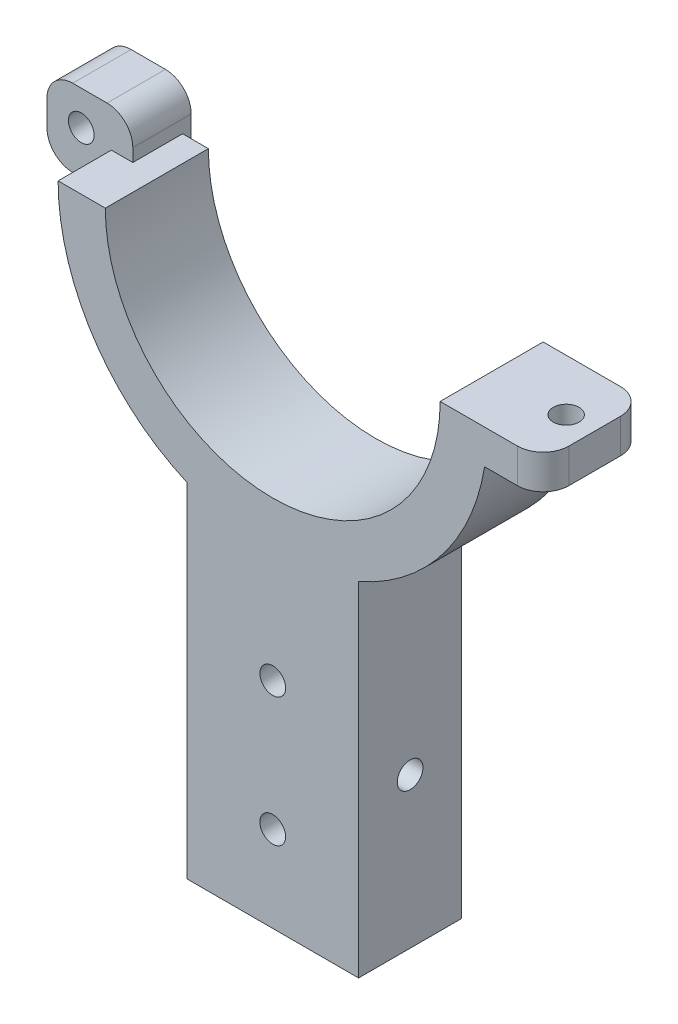
ISO-10303-21;
HEADER;
FILE_DESCRIPTION(('STEP AP214'),'2;1');
FILE_NAME('part.step','',(''),(''),'','','');
FILE_SCHEMA(('AUTOMOTIVE_DESIGN { 1 0 10303 214 1 1 1 1 }'));
ENDSEC;
DATA;
#1=APPLICATION_CONTEXT('core data for automotive mechanical design processes');
#2=APPLICATION_PROTOCOL_DEFINITION('international standard','automotive_design',2000,#1);
#3=PRODUCT_CONTEXT('',#1,'mechanical');
#4=PRODUCT('Part','Part','',(#3));
#5=PRODUCT_RELATED_PRODUCT_CATEGORY('part','',(#4));
#6=PRODUCT_DEFINITION_FORMATION('','',#4);
#7=PRODUCT_DEFINITION_CONTEXT('part definition',#1,'design');
#8=PRODUCT_DEFINITION('design','',#6,#7);
#9=PRODUCT_DEFINITION_SHAPE('','',#8);
#10=(LENGTH_UNIT() NAMED_UNIT(*) SI_UNIT(.MILLI.,.METRE.));
#11=(NAMED_UNIT(*) PLANE_ANGLE_UNIT() SI_UNIT($,.RADIAN.));
#12=(NAMED_UNIT(*) SI_UNIT($,.STERADIAN.) SOLID_ANGLE_UNIT());
#13=UNCERTAINTY_MEASURE_WITH_UNIT(LENGTH_MEASURE(1.E-05),#10,'distance_accuracy_value','');
#14=(GEOMETRIC_REPRESENTATION_CONTEXT(3) GLOBAL_UNCERTAINTY_ASSIGNED_CONTEXT((#13)) GLOBAL_UNIT_ASSIGNED_CONTEXT((#10,
#11,#12)) REPRESENTATION_CONTEXT('',''));
#15=CARTESIAN_POINT('',(0.,0.,0.));
#16=DIRECTION('',(0.,0.,1.));
#17=DIRECTION('',(1.,0.,0.));
#18=AXIS2_PLACEMENT_3D('',#15,#16,#17);
#19=CARTESIAN_POINT('',(28.4999999999988,0.,9.));
#20=DIRECTION('',(0.,1.,0.));
#21=DIRECTION('',(0.,0.,1.));
#22=AXIS2_PLACEMENT_3D('',#19,#20,#21);
#23=CYLINDRICAL_SURFACE('',#22,3.);
#24=DIRECTION('',(0.,1.,0.));
#25=VECTOR('',#24,1.);
#26=CARTESIAN_POINT('',(28.4999999999988,0.,12.));
#27=LINE('',#26,#25);
#28=CARTESIAN_POINT('',(28.4999999999988,-3.99999999999576,12.));
#29=VERTEX_POINT('',#28);
#30=CARTESIAN_POINT('',(28.4999999999988,4.24313362223927E-12,12.));
#31=VERTEX_POINT('',#30);
#32=EDGE_CURVE('E317',#29,#31,#27,.T.);
#33=ORIENTED_EDGE('',*,*,#32,.F.);
#34=CARTESIAN_POINT('',(28.4999999999988,-3.99999999999576,9.));
#35=DIRECTION('',(0.,-1.,0.));
#36=DIRECTION('',(0.,0.,-1.));
#37=AXIS2_PLACEMENT_3D('',#34,#35,#36);
#38=CIRCLE('',#37,3.);
#39=CARTESIAN_POINT('',(31.4999999999988,-3.99999999999576,9.));
#40=VERTEX_POINT('',#39);
#41=EDGE_CURVE('E44',#40,#29,#38,.T.);
#42=ORIENTED_EDGE('',*,*,#41,.F.);
#43=DIRECTION('',(0.,1.,0.));
#44=VECTOR('',#43,1.);
#45=CARTESIAN_POINT('',(31.4999999999988,4.24313362223927E-12,9.));
#46=LINE('',#45,#44);
#47=CARTESIAN_POINT('',(31.4999999999988,4.24313362223927E-12,9.));
#48=VERTEX_POINT('',#47);
#49=EDGE_CURVE('E320',#48,#40,#46,.F.);
#50=ORIENTED_EDGE('',*,*,#49,.F.);
#51=CARTESIAN_POINT('',(28.4999999999988,4.24313362223927E-12,9.));
#52=DIRECTION('',(0.,1.,0.));
#53=DIRECTION('',(0.,0.,1.));
#54=AXIS2_PLACEMENT_3D('',#51,#52,#53);
#55=CIRCLE('',#54,3.);
#56=EDGE_CURVE('E11',#31,#48,#55,.T.);
#57=ORIENTED_EDGE('',*,*,#56,.F.);
#58=EDGE_LOOP('',(#33,#42,#50,#57));
#59=FACE_BOUND('',#58,.T.);
#60=ADVANCED_FACE('F36',(#59),#23,.T.);
#61=CARTESIAN_POINT('',(28.4999999999988,0.,3.));
#62=DIRECTION('',(0.,1.,0.));
#63=DIRECTION('',(0.,0.,1.));
#64=AXIS2_PLACEMENT_3D('',#61,#62,#63);
#65=CYLINDRICAL_SURFACE('',#64,3.);
#66=DIRECTION('',(0.,-1.,0.));
#67=VECTOR('',#66,1.);
#68=CARTESIAN_POINT('',(28.4999999999988,0.,0.));
#69=LINE('',#68,#67);
#70=CARTESIAN_POINT('',(28.4999999999988,4.24313362223927E-12,0.));
#71=VERTEX_POINT('',#70);
#72=CARTESIAN_POINT('',(28.4999999999988,-3.99999999999576,0.));
#73=VERTEX_POINT('',#72);
#74=EDGE_CURVE('E306',#71,#73,#69,.T.);
#75=ORIENTED_EDGE('',*,*,#74,.F.);
#76=CARTESIAN_POINT('',(28.4999999999988,4.24313362223927E-12,3.));
#77=DIRECTION('',(0.,1.,0.));
#78=DIRECTION('',(0.,0.,1.));
#79=AXIS2_PLACEMENT_3D('',#76,#77,#78);
#80=CIRCLE('',#79,3.);
#81=CARTESIAN_POINT('',(31.4999999999988,4.24313362223927E-12,3.));
#82=VERTEX_POINT('',#81);
#83=EDGE_CURVE('E312',#82,#71,#80,.T.);
#84=ORIENTED_EDGE('',*,*,#83,.F.);
#85=DIRECTION('',(0.,-1.,0.));
#86=VECTOR('',#85,1.);
#87=CARTESIAN_POINT('',(31.4999999999988,0.,3.));
#88=LINE('',#87,#86);
#89=CARTESIAN_POINT('',(31.4999999999988,-3.99999999999576,3.));
#90=VERTEX_POINT('',#89);
#91=EDGE_CURVE('E309',#90,#82,#88,.F.);
#92=ORIENTED_EDGE('',*,*,#91,.F.);
#93=CARTESIAN_POINT('',(28.4999999999988,-3.99999999999576,3.));
#94=DIRECTION('',(0.,-1.,0.));
#95=DIRECTION('',(0.,0.,-1.));
#96=AXIS2_PLACEMENT_3D('',#93,#94,#95);
#97=CIRCLE('',#96,3.);
#98=EDGE_CURVE('E314',#73,#90,#97,.T.);
#99=ORIENTED_EDGE('',*,*,#98,.F.);
#100=EDGE_LOOP('',(#75,#84,#92,#99));
#101=FACE_BOUND('',#100,.T.);
#102=ADVANCED_FACE('F420',(#101),#65,.T.);
#103=CARTESIAN_POINT('',(-25.4999999999956,1.50000000000424,-1.));
#104=DIRECTION('',(0.,0.,1.));
#105=DIRECTION('',(1.,0.,0.));
#106=AXIS2_PLACEMENT_3D('',#103,#104,#105);
#107=CYLINDRICAL_SURFACE('',#106,3.);
#108=DIRECTION('',(0.,0.,1.));
#109=VECTOR('',#108,1.);
#110=CARTESIAN_POINT('',(-22.4999999999956,1.50000000000424,-1.));
#111=LINE('',#110,#109);
#112=CARTESIAN_POINT('',(-22.4999999999956,1.50000000000424,-1.));
#113=VERTEX_POINT('',#112);
#114=CARTESIAN_POINT('',(-22.4999999999956,1.50000000000424,5.8));
#115=VERTEX_POINT('',#114);
#116=EDGE_CURVE('E298',#113,#115,#111,.T.);
#117=ORIENTED_EDGE('',*,*,#116,.F.);
#118=CARTESIAN_POINT('',(-25.4999999999956,1.50000000000424,-1.));
#119=DIRECTION('',(0.,0.,-1.));
#120=DIRECTION('',(-1.,0.,0.));
#121=AXIS2_PLACEMENT_3D('',#118,#119,#120);
#122=CIRCLE('',#121,3.);
#123=CARTESIAN_POINT('',(-25.4999999999956,4.50000000000424,-1.));
#124=VERTEX_POINT('',#123);
#125=EDGE_CURVE('E182',#124,#113,#122,.T.);
#126=ORIENTED_EDGE('',*,*,#125,.F.);
#127=DIRECTION('',(0.,0.,1.));
#128=VECTOR('',#127,1.);
#129=CARTESIAN_POINT('',(-25.4999999999956,4.50000000000424,-1.));
#130=LINE('',#129,#128);
#131=CARTESIAN_POINT('',(-25.4999999999956,4.50000000000424,5.8));
#132=VERTEX_POINT('',#131);
#133=EDGE_CURVE('E300',#132,#124,#130,.F.);
#134=ORIENTED_EDGE('',*,*,#133,.F.);
#135=CARTESIAN_POINT('',(-25.4999999999956,1.50000000000424,5.8));
#136=DIRECTION('',(0.,0.,-1.));
#137=DIRECTION('',(-1.,0.,0.));
#138=AXIS2_PLACEMENT_3D('',#135,#136,#137);
#139=CIRCLE('',#138,3.);
#140=EDGE_CURVE('E304',#115,#132,#139,.F.);
#141=ORIENTED_EDGE('',*,*,#140,.F.);
#142=EDGE_LOOP('',(#117,#126,#134,#141));
#143=FACE_BOUND('',#142,.T.);
#144=ADVANCED_FACE('F378',(#143),#107,.T.);
#145=CARTESIAN_POINT('',(-29.4999999999956,1.50000000000424,-1.));
#146=DIRECTION('',(0.,0.,1.));
#147=DIRECTION('',(1.,0.,0.));
#148=AXIS2_PLACEMENT_3D('',#145,#146,#147);
#149=CYLINDRICAL_SURFACE('',#148,3.);
#150=DIRECTION('',(0.,0.,1.));
#151=VECTOR('',#150,1.);
#152=CARTESIAN_POINT('',(-29.4999999999956,4.50000000000424,-1.));
#153=LINE('',#152,#151);
#154=CARTESIAN_POINT('',(-29.4999999999956,4.50000000000424,-1.));
#155=VERTEX_POINT('',#154);
#156=CARTESIAN_POINT('',(-29.4999999999956,4.50000000000424,5.8));
#157=VERTEX_POINT('',#156);
#158=EDGE_CURVE('E288',#155,#157,#153,.T.);
#159=ORIENTED_EDGE('',*,*,#158,.F.);
#160=CARTESIAN_POINT('',(-29.4999999999956,1.50000000000424,-1.));
#161=DIRECTION('',(0.,0.,-1.));
#162=DIRECTION('',(-1.,0.,0.));
#163=AXIS2_PLACEMENT_3D('',#160,#161,#162);
#164=CIRCLE('',#163,3.);
#165=CARTESIAN_POINT('',(-32.4999999999956,1.50000000000424,-1.));
#166=VERTEX_POINT('',#165);
#167=EDGE_CURVE('E294',#166,#155,#164,.T.);
#168=ORIENTED_EDGE('',*,*,#167,.F.);
#169=DIRECTION('',(0.,0.,1.));
#170=VECTOR('',#169,1.);
#171=CARTESIAN_POINT('',(-32.4999999999956,1.50000000000424,-1.));
#172=LINE('',#171,#170);
#173=CARTESIAN_POINT('',(-32.4999999999956,1.50000000000424,5.8));
#174=VERTEX_POINT('',#173);
#175=EDGE_CURVE('E291',#174,#166,#172,.F.);
#176=ORIENTED_EDGE('',*,*,#175,.F.);
#177=CARTESIAN_POINT('',(-29.4999999999956,1.50000000000424,5.8));
#178=DIRECTION('',(0.,0.,-1.));
#179=DIRECTION('',(-1.,0.,0.));
#180=AXIS2_PLACEMENT_3D('',#177,#178,#179);
#181=CIRCLE('',#180,3.);
#182=EDGE_CURVE('E296',#157,#174,#181,.F.);
#183=ORIENTED_EDGE('',*,*,#182,.F.);
#184=EDGE_LOOP('',(#159,#168,#176,#183));
#185=FACE_BOUND('',#184,.T.);
#186=ADVANCED_FACE('F371',(#185),#149,.T.);
#187=CARTESIAN_POINT('',(-29.4999999999956,-1.49999999999576,-1.));
#188=DIRECTION('',(0.,0.,1.));
#189=DIRECTION('',(1.,0.,0.));
#190=AXIS2_PLACEMENT_3D('',#187,#188,#189);
#191=CYLINDRICAL_SURFACE('',#190,3.);
#192=DIRECTION('',(0.,0.,1.));
#193=VECTOR('',#192,1.);
#194=CARTESIAN_POINT('',(-32.4999999999956,-1.49999999999576,-1.));
#195=LINE('',#194,#193);
#196=CARTESIAN_POINT('',(-32.4999999999956,-1.49999999999576,-1.));
#197=VERTEX_POINT('',#196);
#198=CARTESIAN_POINT('',(-32.4999999999956,-1.49999999999576,5.8));
#199=VERTEX_POINT('',#198);
#200=EDGE_CURVE('E275',#197,#199,#195,.T.);
#201=ORIENTED_EDGE('',*,*,#200,.F.);
#202=CARTESIAN_POINT('',(-29.4999999999956,-1.49999999999576,-1.));
#203=DIRECTION('',(0.,0.,-1.));
#204=DIRECTION('',(-1.,0.,0.));
#205=AXIS2_PLACEMENT_3D('',#202,#203,#204);
#206=CIRCLE('',#205,3.);
#207=CARTESIAN_POINT('',(-29.4999999999956,-4.49999999999576,-1.));
#208=VERTEX_POINT('',#207);
#209=EDGE_CURVE('E284',#208,#197,#206,.T.);
#210=ORIENTED_EDGE('',*,*,#209,.F.);
#211=DIRECTION('',(0.,0.,1.));
#212=VECTOR('',#211,1.);
#213=CARTESIAN_POINT('',(-29.4999999999956,-4.49999999999576,-1.));
#214=LINE('',#213,#212);
#215=CARTESIAN_POINT('',(-29.4999999999956,-4.49999999999576,5.8));
#216=VERTEX_POINT('',#215);
#217=EDGE_CURVE('E197',#216,#208,#214,.F.);
#218=ORIENTED_EDGE('',*,*,#217,.F.);
#219=CARTESIAN_POINT('',(-29.4999999999956,-1.49999999999576,5.8));
#220=DIRECTION('',(0.,0.,-1.));
#221=DIRECTION('',(-1.,0.,0.));
#222=AXIS2_PLACEMENT_3D('',#219,#220,#221);
#223=CIRCLE('',#222,3.);
#224=EDGE_CURVE('E286',#199,#216,#223,.F.);
#225=ORIENTED_EDGE('',*,*,#224,.F.);
#226=EDGE_LOOP('',(#201,#210,#218,#225));
#227=FACE_BOUND('',#226,.T.);
#228=ADVANCED_FACE('F408',(#227),#191,.T.);
#229=CARTESIAN_POINT('',(0.,4.24313362223927E-12,12.));
#230=DIRECTION('',(0.,1.,0.));
#231=DIRECTION('',(0.,0.,1.));
#232=AXIS2_PLACEMENT_3D('',#229,#230,#231);
#233=PLANE('',#232);
#234=DIRECTION('',(1.,0.,0.));
#235=VECTOR('',#234,1.);
#236=CARTESIAN_POINT('',(0.,4.24313362223927E-12,0.));
#237=LINE('',#236,#235);
#238=CARTESIAN_POINT('',(-22.4999999999956,4.24313362223927E-12,0.));
#239=VERTEX_POINT('',#238);
#240=CARTESIAN_POINT('',(-19.4999999999956,4.24313362223927E-12,0.));
#241=VERTEX_POINT('',#240);
#242=EDGE_CURVE('E217',#239,#241,#237,.T.);
#243=ORIENTED_EDGE('',*,*,#242,.F.);
#244=DIRECTION('',(0.,0.,1.));
#245=VECTOR('',#244,1.);
#246=CARTESIAN_POINT('',(-22.4999999999956,4.24313362223927E-12,12.));
#247=LINE('',#246,#245);
#248=CARTESIAN_POINT('',(-22.4999999999956,4.24313362223927E-12,5.8));
#249=VERTEX_POINT('',#248);
#250=EDGE_CURVE('E208',#239,#249,#247,.T.);
#251=ORIENTED_EDGE('',*,*,#250,.T.);
#252=DIRECTION('',(-1.,0.,0.));
#253=VECTOR('',#252,1.);
#254=CARTESIAN_POINT('',(0.,4.24313362223927E-12,5.8));
#255=LINE('',#254,#253);
#256=CARTESIAN_POINT('',(-24.9999999999984,4.24313362223927E-12,5.8));
#257=VERTEX_POINT('',#256);
#258=EDGE_CURVE('E215',#249,#257,#255,.T.);
#259=ORIENTED_EDGE('',*,*,#258,.T.);
#260=DIRECTION('',(0.,0.,-1.));
#261=VECTOR('',#260,1.);
#262=CARTESIAN_POINT('',(-24.9999999999984,4.24313362223927E-12,12.));
#263=LINE('',#262,#261);
#264=CARTESIAN_POINT('',(-24.9999999999984,4.24313362223927E-12,12.));
#265=VERTEX_POINT('',#264);
#266=EDGE_CURVE('E266',#265,#257,#263,.T.);
#267=ORIENTED_EDGE('',*,*,#266,.F.);
#268=DIRECTION('',(1.,0.,0.));
#269=VECTOR('',#268,1.);
#270=CARTESIAN_POINT('',(0.,4.24313362223927E-12,12.));
#271=LINE('',#270,#269);
#272=CARTESIAN_POINT('',(-19.4999999999956,4.24313362223927E-12,12.));
#273=VERTEX_POINT('',#272);
#274=EDGE_CURVE('E218',#265,#273,#271,.T.);
#275=ORIENTED_EDGE('',*,*,#274,.T.);
#276=DIRECTION('',(0.,0.,-1.));
#277=VECTOR('',#276,1.);
#278=CARTESIAN_POINT('',(-19.4999999999956,4.24313362223927E-12,12.));
#279=LINE('',#278,#277);
#280=EDGE_CURVE('E236',#273,#241,#279,.T.);
#281=ORIENTED_EDGE('',*,*,#280,.T.);
#282=EDGE_LOOP('',(#243,#251,#259,#267,#275,#281));
#283=FACE_BOUND('',#282,.T.);
#284=ADVANCED_FACE('F386',(#283),#233,.T.);
#285=CARTESIAN_POINT('',(1.61352535947866E-12,4.2404656276164E-12,12.));
#286=DIRECTION('',(0.,0.,-1.));
#287=DIRECTION('',(-1.,0.,0.));
#288=AXIS2_PLACEMENT_3D('',#285,#286,#287);
#289=CYLINDRICAL_SURFACE('',#288,24.9999999999972);
#290=DIRECTION('',(0.,0.,-1.));
#291=VECTOR('',#290,1.);
#292=CARTESIAN_POINT('',(-24.5916652547114,-4.49999999999576,12.));
#293=LINE('',#292,#291);
#294=CARTESIAN_POINT('',(-24.5916652547114,-4.49999999999576,0.));
#295=VERTEX_POINT('',#294);
#296=CARTESIAN_POINT('',(-24.5916652547114,-4.49999999999576,5.8));
#297=VERTEX_POINT('',#296);
#298=EDGE_CURVE('E204',#295,#297,#293,.F.);
#299=ORIENTED_EDGE('',*,*,#298,.F.);
#300=CARTESIAN_POINT('',(1.61352535947866E-12,4.2404656276164E-12,0.));
#301=DIRECTION('',(0.,0.,1.));
#302=DIRECTION('',(1.,0.,0.));
#303=AXIS2_PLACEMENT_3D('',#300,#301,#302);
#304=CIRCLE('',#303,24.9999999999972);
#305=CARTESIAN_POINT('',(-9.99999999999783,-22.9128784747737,0.));
#306=VERTEX_POINT('',#305);
#307=EDGE_CURVE('E238',#295,#306,#304,.T.);
#308=ORIENTED_EDGE('',*,*,#307,.T.);
#309=DIRECTION('',(0.,0.,-1.));
#310=VECTOR('',#309,1.);
#311=CARTESIAN_POINT('',(-9.99999999999783,-22.9128784747737,12.));
#312=LINE('',#311,#310);
#313=CARTESIAN_POINT('',(-9.99999999999783,-22.9128784747737,12.));
#314=VERTEX_POINT('',#313);
#315=EDGE_CURVE('E263',#314,#306,#312,.T.);
#316=ORIENTED_EDGE('',*,*,#315,.F.);
#317=CARTESIAN_POINT('',(1.61352535947866E-12,4.2404656276164E-12,12.));
#318=DIRECTION('',(0.,0.,1.));
#319=DIRECTION('',(1.,0.,0.));
#320=AXIS2_PLACEMENT_3D('',#317,#318,#319);
#321=CIRCLE('',#320,24.9999999999972);
#322=EDGE_CURVE('E221',#265,#314,#321,.T.);
#323=ORIENTED_EDGE('',*,*,#322,.F.);
#324=ORIENTED_EDGE('',*,*,#266,.T.);
#325=CARTESIAN_POINT('',(1.61352535947866E-12,4.2404656276164E-12,5.8));
#326=DIRECTION('',(0.,0.,-1.));
#327=DIRECTION('',(-1.,0.,0.));
#328=AXIS2_PLACEMENT_3D('',#325,#326,#327);
#329=CIRCLE('',#328,24.9999999999972);
#330=EDGE_CURVE('E272',#297,#257,#329,.T.);
#331=ORIENTED_EDGE('',*,*,#330,.F.);
#332=EDGE_LOOP('',(#299,#308,#316,#323,#324,#331));
#333=FACE_BOUND('',#332,.T.);
#334=ADVANCED_FACE('F390',(#333),#289,.T.);
#335=CARTESIAN_POINT('',(0.,0.,0.));
#336=DIRECTION('',(0.,0.,1.));
#337=DIRECTION('',(1.,0.,0.));
#338=AXIS2_PLACEMENT_3D('',#335,#336,#337);
#339=PLANE('',#338);
#340=CARTESIAN_POINT('',(1.05991604382183E-12,-52.912878474775,0.));
#341=DIRECTION('',(0.,0.,-1.));
#342=DIRECTION('',(-1.,0.,0.));
#343=AXIS2_PLACEMENT_3D('',#340,#341,#342);
#344=CIRCLE('',#343,1.5);
#345=CARTESIAN_POINT('',(-1.49999999999894,-52.912878474775,0.));
#346=VERTEX_POINT('',#345);
#347=EDGE_CURVE('E336',#346,#346,#344,.T.);
#348=ORIENTED_EDGE('',*,*,#347,.F.);
#349=EDGE_LOOP('',(#348));
#350=FACE_BOUND('',#349,.T.);
#351=CARTESIAN_POINT('',(1.05991604382183E-12,-37.912878474775,0.));
#352=DIRECTION('',(0.,0.,-1.));
#353=DIRECTION('',(-1.,0.,0.));
#354=AXIS2_PLACEMENT_3D('',#351,#352,#353);
#355=CIRCLE('',#354,1.5);
#356=CARTESIAN_POINT('',(-1.49999999999894,-37.912878474775,0.));
#357=VERTEX_POINT('',#356);
#358=EDGE_CURVE('E325',#357,#357,#355,.T.);
#359=ORIENTED_EDGE('',*,*,#358,.F.);
#360=EDGE_LOOP('',(#359));
#361=FACE_BOUND('',#360,.T.);
#362=CARTESIAN_POINT('',(19.4999999999988,4.24313362223927E-12,0.));
#363=VERTEX_POINT('',#362);
#364=EDGE_CURVE('E239',#363,#71,#237,.T.);
#365=ORIENTED_EDGE('',*,*,#364,.T.);
#366=ORIENTED_EDGE('',*,*,#74,.T.);
#367=DIRECTION('',(-1.,0.,0.));
#368=VECTOR('',#367,1.);
#369=CARTESIAN_POINT('',(31.4999999999988,-3.99999999999576,0.));
#370=LINE('',#369,#368);
#371=CARTESIAN_POINT('',(24.6779253585049,-3.99999999999576,0.));
#372=VERTEX_POINT('',#371);
#373=EDGE_CURVE('E342',#73,#372,#370,.T.);
#374=ORIENTED_EDGE('',*,*,#373,.T.);
#375=CARTESIAN_POINT('',(10.0000000000011,-22.9128784747737,0.));
#376=VERTEX_POINT('',#375);
#377=EDGE_CURVE('E242',#376,#372,#304,.T.);
#378=ORIENTED_EDGE('',*,*,#377,.F.);
#379=DIRECTION('',(0.,-1.,0.));
#380=VECTOR('',#379,1.);
#381=CARTESIAN_POINT('',(10.0000000000016,0.,0.));
#382=LINE('',#381,#380);
#383=CARTESIAN_POINT('',(10.0000000000016,-62.912878474775,0.));
#384=VERTEX_POINT('',#383);
#385=EDGE_CURVE('E247',#376,#384,#382,.T.);
#386=ORIENTED_EDGE('',*,*,#385,.T.);
#387=DIRECTION('',(1.,0.,0.));
#388=VECTOR('',#387,1.);
#389=CARTESIAN_POINT('',(0.,-62.912878474775,0.));
#390=LINE('',#389,#388);
#391=CARTESIAN_POINT('',(-9.99999999999838,-62.912878474775,0.));
#392=VERTEX_POINT('',#391);
#393=EDGE_CURVE('E244',#392,#384,#390,.T.);
#394=ORIENTED_EDGE('',*,*,#393,.F.);
#395=DIRECTION('',(0.,-1.,0.));
#396=VECTOR('',#395,1.);
#397=CARTESIAN_POINT('',(-9.99999999999838,0.,0.));
#398=LINE('',#397,#396);
#399=EDGE_CURVE('E241',#306,#392,#398,.T.);
#400=ORIENTED_EDGE('',*,*,#399,.F.);
#401=ORIENTED_EDGE('',*,*,#307,.F.);
#402=DIRECTION('',(-1.,0.,0.));
#403=VECTOR('',#402,1.);
#404=CARTESIAN_POINT('',(0.,-4.49999999999576,0.));
#405=LINE('',#404,#403);
#406=CARTESIAN_POINT('',(-22.4999999999956,-4.49999999999576,0.));
#407=VERTEX_POINT('',#406);
#408=EDGE_CURVE('E269',#407,#295,#405,.T.);
#409=ORIENTED_EDGE('',*,*,#408,.F.);
#410=DIRECTION('',(0.,-1.,0.));
#411=VECTOR('',#410,1.);
#412=CARTESIAN_POINT('',(-22.4999999999956,0.,0.));
#413=LINE('',#412,#411);
#414=EDGE_CURVE('E203',#239,#407,#413,.T.);
#415=ORIENTED_EDGE('',*,*,#414,.F.);
#416=ORIENTED_EDGE('',*,*,#242,.T.);
#417=CARTESIAN_POINT('',(1.61762964134837E-12,4.24313362223927E-12,0.));
#418=DIRECTION('',(0.,0.,1.));
#419=DIRECTION('',(1.,0.,0.));
#420=AXIS2_PLACEMENT_3D('',#417,#418,#419);
#421=CIRCLE('',#420,19.4999999999972);
#422=EDGE_CURVE('E222',#241,#363,#421,.T.);
#423=ORIENTED_EDGE('',*,*,#422,.T.);
#424=EDGE_LOOP('',(#365,#366,#374,#378,#386,#394,#400,#401,#409,#415,#416,#423));
#425=FACE_BOUND('',#424,.T.);
#426=ADVANCED_FACE('F405',(#350,#361,#425),#339,.F.);
#427=CARTESIAN_POINT('',(-9.99999999999838,0.,12.));
#428=DIRECTION('',(1.,0.,0.));
#429=DIRECTION('',(0.,1.,0.));
#430=AXIS2_PLACEMENT_3D('',#427,#428,#429);
#431=PLANE('',#430);
#432=CARTESIAN_POINT('',(-9.99999999999838,-45.412878474775,6.));
#433=DIRECTION('',(1.,0.,0.));
#434=DIRECTION('',(0.,1.,0.));
#435=AXIS2_PLACEMENT_3D('',#432,#433,#434);
#436=CIRCLE('',#435,1.5);
#437=CARTESIAN_POINT('',(-9.99999999999838,-43.912878474775,6.));
#438=VERTEX_POINT('',#437);
#439=EDGE_CURVE('E517',#438,#438,#436,.T.);
#440=ORIENTED_EDGE('',*,*,#439,.T.);
#441=EDGE_LOOP('',(#440));
#442=FACE_BOUND('',#441,.T.);
#443=ORIENTED_EDGE('',*,*,#399,.T.);
#444=DIRECTION('',(0.,0.,-1.));
#445=VECTOR('',#444,1.);
#446=CARTESIAN_POINT('',(-9.99999999999838,-62.912878474775,12.));
#447=LINE('',#446,#445);
#448=CARTESIAN_POINT('',(-9.99999999999838,-62.912878474775,12.));
#449=VERTEX_POINT('',#448);
#450=EDGE_CURVE('E260',#449,#392,#447,.T.);
#451=ORIENTED_EDGE('',*,*,#450,.F.);
#452=DIRECTION('',(0.,-1.,0.));
#453=VECTOR('',#452,1.);
#454=CARTESIAN_POINT('',(-9.99999999999838,0.,12.));
#455=LINE('',#454,#453);
#456=EDGE_CURVE('E225',#314,#449,#455,.T.);
#457=ORIENTED_EDGE('',*,*,#456,.F.);
#458=ORIENTED_EDGE('',*,*,#315,.T.);
#459=EDGE_LOOP('',(#443,#451,#457,#458));
#460=FACE_BOUND('',#459,.T.);
#461=ADVANCED_FACE('F447',(#442,#460),#431,.F.);
#462=CARTESIAN_POINT('',(0.,-62.912878474775,12.));
#463=DIRECTION('',(0.,1.,0.));
#464=DIRECTION('',(0.,0.,1.));
#465=AXIS2_PLACEMENT_3D('',#462,#463,#464);
#466=PLANE('',#465);
#467=ORIENTED_EDGE('',*,*,#393,.T.);
#468=DIRECTION('',(0.,0.,-1.));
#469=VECTOR('',#468,1.);
#470=CARTESIAN_POINT('',(10.0000000000016,-62.912878474775,12.));
#471=LINE('',#470,#469);
#472=CARTESIAN_POINT('',(10.0000000000016,-62.912878474775,12.));
#473=VERTEX_POINT('',#472);
#474=EDGE_CURVE('E258',#473,#384,#471,.T.);
#475=ORIENTED_EDGE('',*,*,#474,.F.);
#476=DIRECTION('',(1.,0.,0.));
#477=VECTOR('',#476,1.);
#478=CARTESIAN_POINT('',(0.,-62.912878474775,12.));
#479=LINE('',#478,#477);
#480=EDGE_CURVE('E228',#449,#473,#479,.T.);
#481=ORIENTED_EDGE('',*,*,#480,.F.);
#482=ORIENTED_EDGE('',*,*,#450,.T.);
#483=EDGE_LOOP('',(#467,#475,#481,#482));
#484=FACE_BOUND('',#483,.T.);
#485=ADVANCED_FACE('F444',(#484),#466,.F.);
#486=CARTESIAN_POINT('',(10.0000000000016,0.,12.));
#487=DIRECTION('',(1.,0.,0.));
#488=DIRECTION('',(0.,0.,-1.));
#489=AXIS2_PLACEMENT_3D('',#486,#487,#488);
#490=PLANE('',#489);
#491=CARTESIAN_POINT('',(10.0000000000016,-45.412878474775,6.));
#492=DIRECTION('',(1.,0.,0.));
#493=DIRECTION('',(0.,0.,-1.));
#494=AXIS2_PLACEMENT_3D('',#491,#492,#493);
#495=CIRCLE('',#494,1.5);
#496=CARTESIAN_POINT('',(10.0000000000016,-45.412878474775,4.5));
#497=VERTEX_POINT('',#496);
#498=EDGE_CURVE('E515',#497,#497,#495,.T.);
#499=ORIENTED_EDGE('',*,*,#498,.F.);
#500=EDGE_LOOP('',(#499));
#501=FACE_BOUND('',#500,.T.);
#502=ORIENTED_EDGE('',*,*,#385,.F.);
#503=DIRECTION('',(0.,0.,-1.));
#504=VECTOR('',#503,1.);
#505=CARTESIAN_POINT('',(10.0000000000011,-22.9128784747737,12.));
#506=LINE('',#505,#504);
#507=CARTESIAN_POINT('',(10.0000000000011,-22.9128784747737,12.));
#508=VERTEX_POINT('',#507);
#509=EDGE_CURVE('E256',#508,#376,#506,.T.);
#510=ORIENTED_EDGE('',*,*,#509,.F.);
#511=DIRECTION('',(0.,-1.,0.));
#512=VECTOR('',#511,1.);
#513=CARTESIAN_POINT('',(10.0000000000016,0.,12.));
#514=LINE('',#513,#512);
#515=EDGE_CURVE('E230',#508,#473,#514,.T.);
#516=ORIENTED_EDGE('',*,*,#515,.T.);
#517=ORIENTED_EDGE('',*,*,#474,.T.);
#518=EDGE_LOOP('',(#502,#510,#516,#517));
#519=FACE_BOUND('',#518,.T.);
#520=ADVANCED_FACE('F440',(#501,#519),#490,.T.);
#521=ORIENTED_EDGE('',*,*,#377,.T.);
#522=DIRECTION('',(0.,0.,-1.));
#523=VECTOR('',#522,1.);
#524=CARTESIAN_POINT('',(24.6779253585049,-3.99999999999576,12.));
#525=LINE('',#524,#523);
#526=CARTESIAN_POINT('',(24.6779253585049,-3.99999999999576,12.));
#527=VERTEX_POINT('',#526);
#528=EDGE_CURVE('E349',#372,#527,#525,.F.);
#529=ORIENTED_EDGE('',*,*,#528,.T.);
#530=EDGE_CURVE('E226',#508,#527,#321,.T.);
#531=ORIENTED_EDGE('',*,*,#530,.F.);
#532=ORIENTED_EDGE('',*,*,#509,.T.);
#533=EDGE_LOOP('',(#521,#529,#531,#532));
#534=FACE_BOUND('',#533,.T.);
#535=ADVANCED_FACE('F435',(#534),#289,.T.);
#536=CARTESIAN_POINT('',(28.1779253585049,4.24313362223927E-12,6.));
#537=DIRECTION('',(0.,1.,0.));
#538=DIRECTION('',(0.,0.,1.));
#539=AXIS2_PLACEMENT_3D('',#536,#537,#538);
#540=CIRCLE('',#539,1.5);
#541=CARTESIAN_POINT('',(28.1779253585049,4.24313362223927E-12,7.5));
#542=VERTEX_POINT('',#541);
#543=EDGE_CURVE('E329',#542,#542,#540,.T.);
#544=ORIENTED_EDGE('',*,*,#543,.F.);
#545=EDGE_LOOP('',(#544));
#546=FACE_BOUND('',#545,.T.);
#547=CARTESIAN_POINT('',(19.4999999999988,4.24313362223927E-12,12.));
#548=VERTEX_POINT('',#547);
#549=EDGE_CURVE('E223',#548,#31,#271,.T.);
#550=ORIENTED_EDGE('',*,*,#549,.T.);
#551=ORIENTED_EDGE('',*,*,#56,.T.);
#552=DIRECTION('',(0.,0.,-1.));
#553=VECTOR('',#552,1.);
#554=CARTESIAN_POINT('',(31.4999999999988,4.24313362223927E-12,12.));
#555=LINE('',#554,#553);
#556=EDGE_CURVE('E347',#48,#82,#555,.T.);
#557=ORIENTED_EDGE('',*,*,#556,.T.);
#558=ORIENTED_EDGE('',*,*,#83,.T.);
#559=ORIENTED_EDGE('',*,*,#364,.F.);
#560=DIRECTION('',(0.,0.,-1.));
#561=VECTOR('',#560,1.);
#562=CARTESIAN_POINT('',(19.4999999999988,4.24313362223927E-12,12.));
#563=LINE('',#562,#561);
#564=EDGE_CURVE('E254',#548,#363,#563,.T.);
#565=ORIENTED_EDGE('',*,*,#564,.F.);
#566=EDGE_LOOP('',(#550,#551,#557,#558,#559,#565));
#567=FACE_BOUND('',#566,.T.);
#568=ADVANCED_FACE('F416',(#546,#567),#233,.T.);
#569=CARTESIAN_POINT('',(1.61762964134837E-12,4.24313362223927E-12,12.));
#570=DIRECTION('',(0.,0.,-1.));
#571=DIRECTION('',(-1.,0.,0.));
#572=AXIS2_PLACEMENT_3D('',#569,#570,#571);
#573=CYLINDRICAL_SURFACE('',#572,19.4999999999972);
#574=ORIENTED_EDGE('',*,*,#422,.F.);
#575=ORIENTED_EDGE('',*,*,#280,.F.);
#576=CARTESIAN_POINT('',(1.61762964134837E-12,4.24313362223927E-12,12.));
#577=DIRECTION('',(0.,0.,1.));
#578=DIRECTION('',(1.,0.,0.));
#579=AXIS2_PLACEMENT_3D('',#576,#577,#578);
#580=CIRCLE('',#579,19.4999999999972);
#581=EDGE_CURVE('E233',#273,#548,#580,.T.);
#582=ORIENTED_EDGE('',*,*,#581,.T.);
#583=ORIENTED_EDGE('',*,*,#564,.T.);
#584=EDGE_LOOP('',(#574,#575,#582,#583));
#585=FACE_BOUND('',#584,.T.);
#586=ADVANCED_FACE('F401',(#585),#573,.F.);
#587=CARTESIAN_POINT('',(0.,0.,12.));
#588=DIRECTION('',(0.,0.,1.));
#589=DIRECTION('',(1.,0.,0.));
#590=AXIS2_PLACEMENT_3D('',#587,#588,#589);
#591=PLANE('',#590);
#592=CARTESIAN_POINT('',(1.05991604382183E-12,-52.912878474775,12.));
#593=DIRECTION('',(0.,0.,1.));
#594=DIRECTION('',(1.,0.,0.));
#595=AXIS2_PLACEMENT_3D('',#592,#593,#594);
#596=CIRCLE('',#595,1.5);
#597=CARTESIAN_POINT('',(1.50000000000106,-52.912878474775,12.));
#598=VERTEX_POINT('',#597);
#599=EDGE_CURVE('E39',#598,#598,#596,.T.);
#600=ORIENTED_EDGE('',*,*,#599,.F.);
#601=EDGE_LOOP('',(#600));
#602=FACE_BOUND('',#601,.T.);
#603=CARTESIAN_POINT('',(1.05991604382183E-12,-37.912878474775,12.));
#604=DIRECTION('',(0.,0.,1.));
#605=DIRECTION('',(1.,0.,0.));
#606=AXIS2_PLACEMENT_3D('',#603,#604,#605);
#607=CIRCLE('',#606,1.5);
#608=CARTESIAN_POINT('',(1.50000000000106,-37.912878474775,12.));
#609=VERTEX_POINT('',#608);
#610=EDGE_CURVE('E322',#609,#609,#607,.T.);
#611=ORIENTED_EDGE('',*,*,#610,.F.);
#612=EDGE_LOOP('',(#611));
#613=FACE_BOUND('',#612,.T.);
#614=DIRECTION('',(-1.,0.,0.));
#615=VECTOR('',#614,1.);
#616=CARTESIAN_POINT('',(31.4999999999988,-3.99999999999576,12.));
#617=LINE('',#616,#615);
#618=EDGE_CURVE('E343',#29,#527,#617,.T.);
#619=ORIENTED_EDGE('',*,*,#618,.F.);
#620=ORIENTED_EDGE('',*,*,#32,.T.);
#621=ORIENTED_EDGE('',*,*,#549,.F.);
#622=ORIENTED_EDGE('',*,*,#581,.F.);
#623=ORIENTED_EDGE('',*,*,#274,.F.);
#624=ORIENTED_EDGE('',*,*,#322,.T.);
#625=ORIENTED_EDGE('',*,*,#456,.T.);
#626=ORIENTED_EDGE('',*,*,#480,.T.);
#627=ORIENTED_EDGE('',*,*,#515,.F.);
#628=ORIENTED_EDGE('',*,*,#530,.T.);
#629=EDGE_LOOP('',(#619,#620,#621,#622,#623,#624,#625,#626,#627,#628));
#630=FACE_BOUND('',#629,.T.);
#631=ADVANCED_FACE('F397',(#602,#613,#630),#591,.T.);
#632=CARTESIAN_POINT('',(-22.4999999999956,-4.49999999999576,-1.));
#633=DIRECTION('',(0.,1.,0.));
#634=DIRECTION('',(0.,0.,1.));
#635=AXIS2_PLACEMENT_3D('',#632,#633,#634);
#636=PLANE('',#635);
#637=DIRECTION('',(-1.,0.,0.));
#638=VECTOR('',#637,1.);
#639=CARTESIAN_POINT('',(-22.4999999999956,-4.49999999999576,5.8));
#640=LINE('',#639,#638);
#641=EDGE_CURVE('E356',#297,#216,#640,.T.);
#642=ORIENTED_EDGE('',*,*,#641,.T.);
#643=ORIENTED_EDGE('',*,*,#217,.T.);
#644=DIRECTION('',(-1.,0.,0.));
#645=VECTOR('',#644,1.);
#646=CARTESIAN_POINT('',(-22.4999999999956,-4.49999999999576,-1.));
#647=LINE('',#646,#645);
#648=CARTESIAN_POINT('',(-22.4999999999956,-4.49999999999576,-1.));
#649=VERTEX_POINT('',#648);
#650=EDGE_CURVE('E181',#649,#208,#647,.T.);
#651=ORIENTED_EDGE('',*,*,#650,.F.);
#652=DIRECTION('',(0.,0.,1.));
#653=VECTOR('',#652,1.);
#654=CARTESIAN_POINT('',(-22.4999999999956,-4.49999999999576,-1.));
#655=LINE('',#654,#653);
#656=EDGE_CURVE('E195',#649,#407,#655,.T.);
#657=ORIENTED_EDGE('',*,*,#656,.T.);
#658=ORIENTED_EDGE('',*,*,#408,.T.);
#659=ORIENTED_EDGE('',*,*,#298,.T.);
#660=EDGE_LOOP('',(#642,#643,#651,#657,#658,#659));
#661=FACE_BOUND('',#660,.T.);
#662=ADVANCED_FACE('F193',(#661),#636,.F.);
#663=CARTESIAN_POINT('',(-22.4999999999956,4.50000000000424,-1.));
#664=DIRECTION('',(-1.,0.,0.));
#665=DIRECTION('',(0.,0.,1.));
#666=AXIS2_PLACEMENT_3D('',#663,#664,#665);
#667=PLANE('',#666);
#668=DIRECTION('',(0.,-1.,0.));
#669=VECTOR('',#668,1.);
#670=CARTESIAN_POINT('',(-22.4999999999956,4.50000000000424,-1.));
#671=LINE('',#670,#669);
#672=EDGE_CURVE('E177',#113,#649,#671,.T.);
#673=ORIENTED_EDGE('',*,*,#672,.F.);
#674=ORIENTED_EDGE('',*,*,#116,.T.);
#675=DIRECTION('',(0.,-1.,0.));
#676=VECTOR('',#675,1.);
#677=CARTESIAN_POINT('',(-22.4999999999956,4.50000000000424,5.8));
#678=LINE('',#677,#676);
#679=EDGE_CURVE('E279',#115,#249,#678,.T.);
#680=ORIENTED_EDGE('',*,*,#679,.T.);
#681=ORIENTED_EDGE('',*,*,#250,.F.);
#682=ORIENTED_EDGE('',*,*,#414,.T.);
#683=ORIENTED_EDGE('',*,*,#656,.F.);
#684=EDGE_LOOP('',(#673,#674,#680,#681,#682,#683));
#685=FACE_BOUND('',#684,.T.);
#686=ADVANCED_FACE('F201',(#685),#667,.F.);
#687=CARTESIAN_POINT('',(-32.4999999999956,4.50000000000424,-1.));
#688=DIRECTION('',(1.,0.,0.));
#689=DIRECTION('',(0.,0.,-1.));
#690=AXIS2_PLACEMENT_3D('',#687,#688,#689);
#691=PLANE('',#690);
#692=DIRECTION('',(0.,1.,0.));
#693=VECTOR('',#692,1.);
#694=CARTESIAN_POINT('',(-32.4999999999956,4.50000000000424,5.8));
#695=LINE('',#694,#693);
#696=EDGE_CURVE('E358',#199,#174,#695,.T.);
#697=ORIENTED_EDGE('',*,*,#696,.T.);
#698=ORIENTED_EDGE('',*,*,#175,.T.);
#699=DIRECTION('',(0.,1.,0.));
#700=VECTOR('',#699,1.);
#701=CARTESIAN_POINT('',(-32.4999999999956,4.50000000000424,-1.));
#702=LINE('',#701,#700);
#703=EDGE_CURVE('E198',#197,#166,#702,.T.);
#704=ORIENTED_EDGE('',*,*,#703,.F.);
#705=ORIENTED_EDGE('',*,*,#200,.T.);
#706=EDGE_LOOP('',(#697,#698,#704,#705));
#707=FACE_BOUND('',#706,.T.);
#708=ADVANCED_FACE('F367',(#707),#691,.F.);
#709=CARTESIAN_POINT('',(-22.4999999999956,4.50000000000424,-1.));
#710=DIRECTION('',(0.,-1.,0.));
#711=DIRECTION('',(0.,0.,-1.));
#712=AXIS2_PLACEMENT_3D('',#709,#710,#711);
#713=PLANE('',#712);
#714=DIRECTION('',(1.,0.,0.));
#715=VECTOR('',#714,1.);
#716=CARTESIAN_POINT('',(-22.4999999999956,4.50000000000424,5.8));
#717=LINE('',#716,#715);
#718=EDGE_CURVE('E187',#157,#132,#717,.T.);
#719=ORIENTED_EDGE('',*,*,#718,.T.);
#720=ORIENTED_EDGE('',*,*,#133,.T.);
#721=DIRECTION('',(1.,0.,0.));
#722=VECTOR('',#721,1.);
#723=CARTESIAN_POINT('',(-22.4999999999956,4.50000000000424,-1.));
#724=LINE('',#723,#722);
#725=EDGE_CURVE('E205',#155,#124,#724,.T.);
#726=ORIENTED_EDGE('',*,*,#725,.F.);
#727=ORIENTED_EDGE('',*,*,#158,.T.);
#728=EDGE_LOOP('',(#719,#720,#726,#727));
#729=FACE_BOUND('',#728,.T.);
#730=ADVANCED_FACE('F375',(#729),#713,.F.);
#731=CARTESIAN_POINT('',(0.,0.,-1.));
#732=DIRECTION('',(0.,0.,-1.));
#733=DIRECTION('',(-1.,0.,0.));
#734=AXIS2_PLACEMENT_3D('',#731,#732,#733);
#735=PLANE('',#734);
#736=CARTESIAN_POINT('',(-28.4999999999956,0.500000000004243,-1.));
#737=DIRECTION('',(0.,0.,-1.));
#738=DIRECTION('',(-1.,0.,0.));
#739=AXIS2_PLACEMENT_3D('',#736,#737,#738);
#740=CIRCLE('',#739,1.5);
#741=CARTESIAN_POINT('',(-29.9999999999956,0.500000000004243,-1.));
#742=VERTEX_POINT('',#741);
#743=EDGE_CURVE('E280',#742,#742,#740,.T.);
#744=ORIENTED_EDGE('',*,*,#743,.F.);
#745=EDGE_LOOP('',(#744));
#746=FACE_BOUND('',#745,.T.);
#747=ORIENTED_EDGE('',*,*,#725,.T.);
#748=ORIENTED_EDGE('',*,*,#125,.T.);
#749=ORIENTED_EDGE('',*,*,#672,.T.);
#750=ORIENTED_EDGE('',*,*,#650,.T.);
#751=ORIENTED_EDGE('',*,*,#209,.T.);
#752=ORIENTED_EDGE('',*,*,#703,.T.);
#753=ORIENTED_EDGE('',*,*,#167,.T.);
#754=EDGE_LOOP('',(#747,#748,#749,#750,#751,#752,#753));
#755=FACE_BOUND('',#754,.T.);
#756=ADVANCED_FACE('F180',(#746,#755),#735,.T.);
#757=CARTESIAN_POINT('',(0.,0.,5.8));
#758=DIRECTION('',(0.,0.,-1.));
#759=DIRECTION('',(-1.,0.,0.));
#760=AXIS2_PLACEMENT_3D('',#757,#758,#759);
#761=PLANE('',#760);
#762=CARTESIAN_POINT('',(-28.4999999999956,0.500000000004243,5.8));
#763=DIRECTION('',(0.,0.,-1.));
#764=DIRECTION('',(-1.,0.,0.));
#765=AXIS2_PLACEMENT_3D('',#762,#763,#764);
#766=CIRCLE('',#765,1.5);
#767=CARTESIAN_POINT('',(-29.9999999999956,0.500000000004243,5.8));
#768=VERTEX_POINT('',#767);
#769=EDGE_CURVE('E276',#768,#768,#766,.T.);
#770=ORIENTED_EDGE('',*,*,#769,.T.);
#771=EDGE_LOOP('',(#770));
#772=FACE_BOUND('',#771,.T.);
#773=ORIENTED_EDGE('',*,*,#679,.F.);
#774=ORIENTED_EDGE('',*,*,#140,.T.);
#775=ORIENTED_EDGE('',*,*,#718,.F.);
#776=ORIENTED_EDGE('',*,*,#182,.T.);
#777=ORIENTED_EDGE('',*,*,#696,.F.);
#778=ORIENTED_EDGE('',*,*,#224,.T.);
#779=ORIENTED_EDGE('',*,*,#641,.F.);
#780=ORIENTED_EDGE('',*,*,#330,.T.);
#781=ORIENTED_EDGE('',*,*,#258,.F.);
#782=EDGE_LOOP('',(#773,#774,#775,#776,#777,#778,#779,#780,#781));
#783=FACE_BOUND('',#782,.T.);
#784=ADVANCED_FACE('F382',(#772,#783),#761,.F.);
#785=CARTESIAN_POINT('',(-28.4999999999956,0.500000000004243,9.));
#786=DIRECTION('',(0.,0.,-1.));
#787=DIRECTION('',(-1.,0.,0.));
#788=AXIS2_PLACEMENT_3D('',#785,#786,#787);
#789=CYLINDRICAL_SURFACE('',#788,1.5);
#790=ORIENTED_EDGE('',*,*,#743,.T.);
#791=EDGE_LOOP('',(#790));
#792=FACE_BOUND('',#791,.T.);
#793=ORIENTED_EDGE('',*,*,#769,.F.);
#794=EDGE_LOOP('',(#793));
#795=FACE_BOUND('',#794,.T.);
#796=ADVANCED_FACE('F484',(#792,#795),#789,.F.);
#797=CARTESIAN_POINT('',(31.4999999999988,-3.99999999999576,12.));
#798=DIRECTION('',(0.,-1.,0.));
#799=DIRECTION('',(0.,0.,-1.));
#800=AXIS2_PLACEMENT_3D('',#797,#798,#799);
#801=PLANE('',#800);
#802=CARTESIAN_POINT('',(28.1779253585049,-3.99999999999576,6.));
#803=DIRECTION('',(0.,-1.,0.));
#804=DIRECTION('',(0.,0.,-1.));
#805=AXIS2_PLACEMENT_3D('',#802,#803,#804);
#806=CIRCLE('',#805,1.5);
#807=CARTESIAN_POINT('',(28.1779253585049,-3.99999999999576,4.5));
#808=VERTEX_POINT('',#807);
#809=EDGE_CURVE('E324',#808,#808,#806,.T.);
#810=ORIENTED_EDGE('',*,*,#809,.F.);
#811=EDGE_LOOP('',(#810));
#812=FACE_BOUND('',#811,.T.);
#813=DIRECTION('',(0.,0.,-1.));
#814=VECTOR('',#813,1.);
#815=CARTESIAN_POINT('',(31.4999999999988,-3.99999999999576,12.));
#816=LINE('',#815,#814);
#817=EDGE_CURVE('E345',#40,#90,#816,.T.);
#818=ORIENTED_EDGE('',*,*,#817,.F.);
#819=ORIENTED_EDGE('',*,*,#41,.T.);
#820=ORIENTED_EDGE('',*,*,#618,.T.);
#821=ORIENTED_EDGE('',*,*,#528,.F.);
#822=ORIENTED_EDGE('',*,*,#373,.F.);
#823=ORIENTED_EDGE('',*,*,#98,.T.);
#824=EDGE_LOOP('',(#818,#819,#820,#821,#822,#823));
#825=FACE_BOUND('',#824,.T.);
#826=ADVANCED_FACE('F431',(#812,#825),#801,.T.);
#827=CARTESIAN_POINT('',(31.4999999999988,4.24313362223927E-12,12.));
#828=DIRECTION('',(1.,0.,0.));
#829=DIRECTION('',(0.,0.,-1.));
#830=AXIS2_PLACEMENT_3D('',#827,#828,#829);
#831=PLANE('',#830);
#832=ORIENTED_EDGE('',*,*,#556,.F.);
#833=ORIENTED_EDGE('',*,*,#49,.T.);
#834=ORIENTED_EDGE('',*,*,#817,.T.);
#835=ORIENTED_EDGE('',*,*,#91,.T.);
#836=EDGE_LOOP('',(#832,#833,#834,#835));
#837=FACE_BOUND('',#836,.T.);
#838=ADVANCED_FACE('F489',(#837),#831,.T.);
#839=CARTESIAN_POINT('',(28.1779253585049,8.00000000000424,6.));
#840=DIRECTION('',(0.,-1.,0.));
#841=DIRECTION('',(0.,0.,-1.));
#842=AXIS2_PLACEMENT_3D('',#839,#840,#841);
#843=CYLINDRICAL_SURFACE('',#842,1.5);
#844=ORIENTED_EDGE('',*,*,#543,.T.);
#845=EDGE_LOOP('',(#844));
#846=FACE_BOUND('',#845,.T.);
#847=ORIENTED_EDGE('',*,*,#809,.T.);
#848=EDGE_LOOP('',(#847));
#849=FACE_BOUND('',#848,.T.);
#850=ADVANCED_FACE('F492',(#846,#849),#843,.F.);
#851=CARTESIAN_POINT('',(1.05991604382183E-12,-37.912878474775,20.));
#852=DIRECTION('',(0.,0.,-1.));
#853=DIRECTION('',(-1.,0.,0.));
#854=AXIS2_PLACEMENT_3D('',#851,#852,#853);
#855=CYLINDRICAL_SURFACE('',#854,1.5);
#856=ORIENTED_EDGE('',*,*,#610,.T.);
#857=EDGE_LOOP('',(#856));
#858=FACE_BOUND('',#857,.T.);
#859=ORIENTED_EDGE('',*,*,#358,.T.);
#860=EDGE_LOOP('',(#859));
#861=FACE_BOUND('',#860,.T.);
#862=ADVANCED_FACE('F499',(#858,#861),#855,.F.);
#863=CARTESIAN_POINT('',(1.05991604382183E-12,-52.912878474775,20.));
#864=DIRECTION('',(0.,0.,-1.));
#865=DIRECTION('',(-1.,0.,0.));
#866=AXIS2_PLACEMENT_3D('',#863,#864,#865);
#867=CYLINDRICAL_SURFACE('',#866,1.5);
#868=ORIENTED_EDGE('',*,*,#599,.T.);
#869=EDGE_LOOP('',(#868));
#870=FACE_BOUND('',#869,.T.);
#871=ORIENTED_EDGE('',*,*,#347,.T.);
#872=EDGE_LOOP('',(#871));
#873=FACE_BOUND('',#872,.T.);
#874=ADVANCED_FACE('F503',(#870,#873),#867,.F.);
#875=CARTESIAN_POINT('',(-19.9999999999984,-45.412878474775,6.));
#876=DIRECTION('',(1.,0.,0.));
#877=DIRECTION('',(0.,0.,-1.));
#878=AXIS2_PLACEMENT_3D('',#875,#876,#877);
#879=CYLINDRICAL_SURFACE('',#878,1.5);
#880=ORIENTED_EDGE('',*,*,#498,.T.);
#881=EDGE_LOOP('',(#880));
#882=FACE_BOUND('',#881,.T.);
#883=ORIENTED_EDGE('',*,*,#439,.F.);
#884=EDGE_LOOP('',(#883));
#885=FACE_BOUND('',#884,.T.);
#886=ADVANCED_FACE('F506',(#882,#885),#879,.F.);
#887=CLOSED_SHELL('',(#60,#102,#144,#186,#228,#284,#334,#426,#461,#485,#520,#535,#568,#586,#631,
#662,#686,#708,#730,#756,#784,#796,#826,#838,#850,#862,#874,#886));
#888=MANIFOLD_SOLID_BREP('B2',#887);
#889=ADVANCED_BREP_SHAPE_REPRESENTATION('',(#18,#888),#14);
#890=SHAPE_DEFINITION_REPRESENTATION(#9,#889);
ENDSEC;
END-ISO-10303-21;
